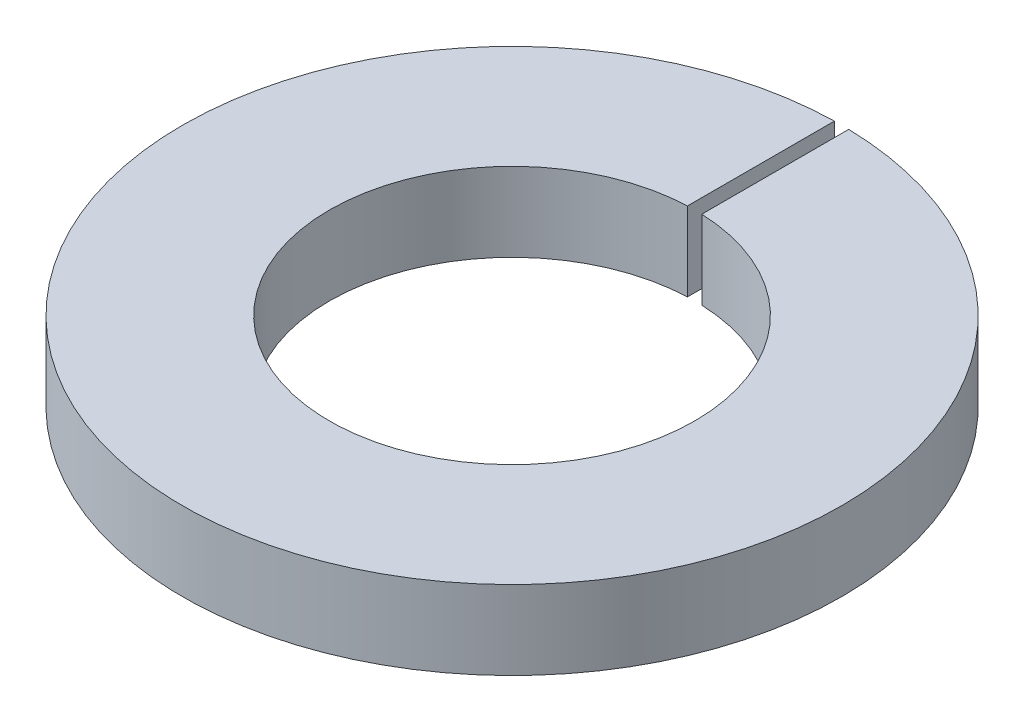
ISO-10303-21;
HEADER;
FILE_DESCRIPTION(('STEP AP214'),'2;1');
FILE_NAME('part.step','',(''),(''),'','','');
FILE_SCHEMA(('AUTOMOTIVE_DESIGN { 1 0 10303 214 1 1 1 1 }'));
ENDSEC;
DATA;
#1=APPLICATION_CONTEXT('core data for automotive mechanical design processes');
#2=APPLICATION_PROTOCOL_DEFINITION('international standard','automotive_design',2000,#1);
#3=PRODUCT_CONTEXT('',#1,'mechanical');
#4=PRODUCT('Part','Part','',(#3));
#5=PRODUCT_RELATED_PRODUCT_CATEGORY('part','',(#4));
#6=PRODUCT_DEFINITION_FORMATION('','',#4);
#7=PRODUCT_DEFINITION_CONTEXT('part definition',#1,'design');
#8=PRODUCT_DEFINITION('design','',#6,#7);
#9=PRODUCT_DEFINITION_SHAPE('','',#8);
#10=(LENGTH_UNIT() NAMED_UNIT(*) SI_UNIT(.MILLI.,.METRE.));
#11=(NAMED_UNIT(*) PLANE_ANGLE_UNIT() SI_UNIT($,.RADIAN.));
#12=(NAMED_UNIT(*) SI_UNIT($,.STERADIAN.) SOLID_ANGLE_UNIT());
#13=UNCERTAINTY_MEASURE_WITH_UNIT(LENGTH_MEASURE(1.E-05),#10,'distance_accuracy_value','');
#14=(GEOMETRIC_REPRESENTATION_CONTEXT(3) GLOBAL_UNCERTAINTY_ASSIGNED_CONTEXT((#13)) GLOBAL_UNIT_ASSIGNED_CONTEXT((#10,
#11,#12)) REPRESENTATION_CONTEXT('',''));
#15=CARTESIAN_POINT('',(0.,0.,0.));
#16=DIRECTION('',(0.,0.,1.));
#17=DIRECTION('',(1.,0.,0.));
#18=AXIS2_PLACEMENT_3D('',#15,#16,#17);
#19=CARTESIAN_POINT('',(0.,1.1,0.));
#20=DIRECTION('',(0.,-1.,0.));
#21=DIRECTION('',(0.,0.,-1.));
#22=AXIS2_PLACEMENT_3D('',#19,#20,#21);
#23=CYLINDRICAL_SURFACE('',#22,2.55);
#24=CARTESIAN_POINT('',(0.,0.,0.));
#25=DIRECTION('',(0.,-1.,0.));
#26=DIRECTION('',(0.,0.,1.));
#27=AXIS2_PLACEMENT_3D('',#24,#25,#26);
#28=CIRCLE('',#27,2.55);
#29=CARTESIAN_POINT('',(0.0999999999999964,0.,-2.54803846124818));
#30=VERTEX_POINT('',#29);
#31=CARTESIAN_POINT('',(-0.100000000000004,0.,-2.54803846124818));
#32=VERTEX_POINT('',#31);
#33=EDGE_CURVE('E100',#30,#32,#28,.T.);
#34=ORIENTED_EDGE('',*,*,#33,.T.);
#35=DIRECTION('',(0.,-1.,0.));
#36=VECTOR('',#35,1.);
#37=CARTESIAN_POINT('',(-0.100000000000004,1.1,-2.54803846124818));
#38=LINE('',#37,#36);
#39=CARTESIAN_POINT('',(-0.100000000000004,1.1,-2.54803846124818));
#40=VERTEX_POINT('',#39);
#41=EDGE_CURVE('E11',#40,#32,#38,.T.);
#42=ORIENTED_EDGE('',*,*,#41,.F.);
#43=CARTESIAN_POINT('',(0.,1.1,0.));
#44=DIRECTION('',(0.,-1.,0.));
#45=DIRECTION('',(0.,0.,1.));
#46=AXIS2_PLACEMENT_3D('',#43,#44,#45);
#47=CIRCLE('',#46,2.55);
#48=CARTESIAN_POINT('',(0.0999999999999964,1.1,-2.54803846124818));
#49=VERTEX_POINT('',#48);
#50=EDGE_CURVE('E88',#49,#40,#47,.T.);
#51=ORIENTED_EDGE('',*,*,#50,.F.);
#52=DIRECTION('',(0.,-1.,0.));
#53=VECTOR('',#52,1.);
#54=CARTESIAN_POINT('',(0.0999999999999964,1.1,-2.54803846124818));
#55=LINE('',#54,#53);
#56=EDGE_CURVE('E96',#49,#30,#55,.T.);
#57=ORIENTED_EDGE('',*,*,#56,.T.);
#58=EDGE_LOOP('',(#34,#42,#51,#57));
#59=FACE_BOUND('',#58,.T.);
#60=ADVANCED_FACE('F37',(#59),#23,.F.);
#61=CARTESIAN_POINT('',(-0.100000000000004,1.1,-4.59891291502677));
#62=DIRECTION('',(-1.,0.,0.));
#63=DIRECTION('',(0.,0.,1.));
#64=AXIS2_PLACEMENT_3D('',#61,#62,#63);
#65=PLANE('',#64);
#66=DIRECTION('',(0.,0.,-1.));
#67=VECTOR('',#66,1.);
#68=CARTESIAN_POINT('',(-0.100000000000004,0.,-4.59891291502677));
#69=LINE('',#68,#67);
#70=CARTESIAN_POINT('',(-0.100000000000004,0.,-4.59891291502677));
#71=VERTEX_POINT('',#70);
#72=EDGE_CURVE('E92',#32,#71,#69,.T.);
#73=ORIENTED_EDGE('',*,*,#72,.T.);
#74=DIRECTION('',(0.,-1.,0.));
#75=VECTOR('',#74,1.);
#76=CARTESIAN_POINT('',(-0.100000000000004,1.1,-4.59891291502677));
#77=LINE('',#76,#75);
#78=CARTESIAN_POINT('',(-0.100000000000004,1.1,-4.59891291502677));
#79=VERTEX_POINT('',#78);
#80=EDGE_CURVE('E45',#79,#71,#77,.T.);
#81=ORIENTED_EDGE('',*,*,#80,.F.);
#82=DIRECTION('',(0.,0.,-1.));
#83=VECTOR('',#82,1.);
#84=CARTESIAN_POINT('',(-0.100000000000004,1.1,-4.59891291502677));
#85=LINE('',#84,#83);
#86=EDGE_CURVE('E83',#40,#79,#85,.T.);
#87=ORIENTED_EDGE('',*,*,#86,.F.);
#88=ORIENTED_EDGE('',*,*,#41,.T.);
#89=EDGE_LOOP('',(#73,#81,#87,#88));
#90=FACE_BOUND('',#89,.T.);
#91=ADVANCED_FACE('F91',(#90),#65,.F.);
#92=CARTESIAN_POINT('',(0.,1.1,0.));
#93=DIRECTION('',(0.,-1.,0.));
#94=DIRECTION('',(0.,0.,-1.));
#95=AXIS2_PLACEMENT_3D('',#92,#93,#94);
#96=CYLINDRICAL_SURFACE('',#95,4.6);
#97=CARTESIAN_POINT('',(0.,0.,0.));
#98=DIRECTION('',(0.,1.,0.));
#99=DIRECTION('',(0.,0.,1.));
#100=AXIS2_PLACEMENT_3D('',#97,#98,#99);
#101=CIRCLE('',#100,4.6);
#102=CARTESIAN_POINT('',(0.0999999999999972,0.,-4.59891291502677));
#103=VERTEX_POINT('',#102);
#104=EDGE_CURVE('E70',#71,#103,#101,.T.);
#105=ORIENTED_EDGE('',*,*,#104,.T.);
#106=DIRECTION('',(0.,-1.,0.));
#107=VECTOR('',#106,1.);
#108=CARTESIAN_POINT('',(0.0999999999999972,1.1,-4.59891291502677));
#109=LINE('',#108,#107);
#110=CARTESIAN_POINT('',(0.0999999999999972,1.1,-4.59891291502677));
#111=VERTEX_POINT('',#110);
#112=EDGE_CURVE('E93',#111,#103,#109,.T.);
#113=ORIENTED_EDGE('',*,*,#112,.F.);
#114=CARTESIAN_POINT('',(0.,1.1,0.));
#115=DIRECTION('',(0.,1.,0.));
#116=DIRECTION('',(0.,0.,1.));
#117=AXIS2_PLACEMENT_3D('',#114,#115,#116);
#118=CIRCLE('',#117,4.6);
#119=EDGE_CURVE('E86',#79,#111,#118,.T.);
#120=ORIENTED_EDGE('',*,*,#119,.F.);
#121=ORIENTED_EDGE('',*,*,#80,.T.);
#122=EDGE_LOOP('',(#105,#113,#120,#121));
#123=FACE_BOUND('',#122,.T.);
#124=ADVANCED_FACE('F94',(#123),#96,.T.);
#125=CARTESIAN_POINT('',(0.0999999999999964,1.1,-4.59891291502677));
#126=DIRECTION('',(1.,0.,0.));
#127=DIRECTION('',(0.,0.,-1.));
#128=AXIS2_PLACEMENT_3D('',#125,#126,#127);
#129=PLANE('',#128);
#130=DIRECTION('',(0.,0.,1.));
#131=VECTOR('',#130,1.);
#132=CARTESIAN_POINT('',(0.0999999999999964,0.,-4.59891291502677));
#133=LINE('',#132,#131);
#134=EDGE_CURVE('E76',#103,#30,#133,.T.);
#135=ORIENTED_EDGE('',*,*,#134,.T.);
#136=ORIENTED_EDGE('',*,*,#56,.F.);
#137=DIRECTION('',(0.,0.,1.));
#138=VECTOR('',#137,1.);
#139=CARTESIAN_POINT('',(0.0999999999999964,1.1,-4.59891291502677));
#140=LINE('',#139,#138);
#141=EDGE_CURVE('E53',#111,#49,#140,.T.);
#142=ORIENTED_EDGE('',*,*,#141,.F.);
#143=ORIENTED_EDGE('',*,*,#112,.T.);
#144=EDGE_LOOP('',(#135,#136,#142,#143));
#145=FACE_BOUND('',#144,.T.);
#146=ADVANCED_FACE('F107',(#145),#129,.F.);
#147=CARTESIAN_POINT('',(0.,1.1,0.));
#148=DIRECTION('',(0.,1.,0.));
#149=DIRECTION('',(0.,0.,1.));
#150=AXIS2_PLACEMENT_3D('',#147,#148,#149);
#151=PLANE('',#150);
#152=ORIENTED_EDGE('',*,*,#50,.T.);
#153=ORIENTED_EDGE('',*,*,#86,.T.);
#154=ORIENTED_EDGE('',*,*,#119,.T.);
#155=ORIENTED_EDGE('',*,*,#141,.T.);
#156=EDGE_LOOP('',(#152,#153,#154,#155));
#157=FACE_BOUND('',#156,.T.);
#158=ADVANCED_FACE('F84',(#157),#151,.T.);
#159=CARTESIAN_POINT('',(0.,0.,0.));
#160=DIRECTION('',(0.,1.,0.));
#161=DIRECTION('',(0.,0.,1.));
#162=AXIS2_PLACEMENT_3D('',#159,#160,#161);
#163=PLANE('',#162);
#164=ORIENTED_EDGE('',*,*,#33,.F.);
#165=ORIENTED_EDGE('',*,*,#134,.F.);
#166=ORIENTED_EDGE('',*,*,#104,.F.);
#167=ORIENTED_EDGE('',*,*,#72,.F.);
#168=EDGE_LOOP('',(#164,#165,#166,#167));
#169=FACE_BOUND('',#168,.T.);
#170=ADVANCED_FACE('F110',(#169),#163,.F.);
#171=CLOSED_SHELL('',(#60,#91,#124,#146,#158,#170));
#172=MANIFOLD_SOLID_BREP('B2',#171);
#173=ADVANCED_BREP_SHAPE_REPRESENTATION('',(#18,#172),#14);
#174=SHAPE_DEFINITION_REPRESENTATION(#9,#173);
ENDSEC;
END-ISO-10303-21;
